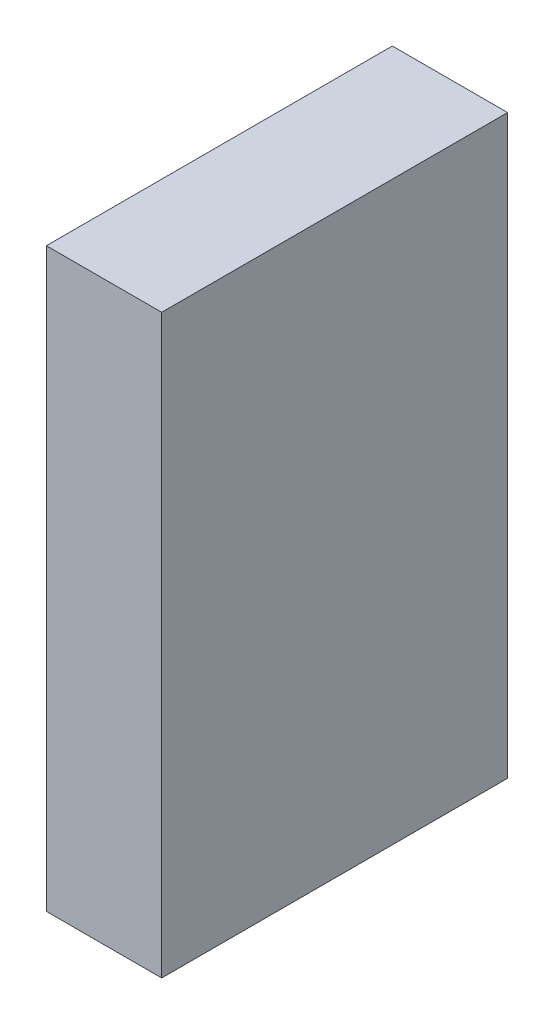
ISO-10303-21;
HEADER;
FILE_DESCRIPTION(('STEP AP214'),'2;1');
FILE_NAME('part.step','',(''),(''),'','','');
FILE_SCHEMA(('AUTOMOTIVE_DESIGN { 1 0 10303 214 1 1 1 1 }'));
ENDSEC;
DATA;
#1=APPLICATION_CONTEXT('core data for automotive mechanical design processes');
#2=APPLICATION_PROTOCOL_DEFINITION('international standard','automotive_design',2000,#1);
#3=PRODUCT_CONTEXT('',#1,'mechanical');
#4=PRODUCT('Part','Part','',(#3));
#5=PRODUCT_RELATED_PRODUCT_CATEGORY('part','',(#4));
#6=PRODUCT_DEFINITION_FORMATION('','',#4);
#7=PRODUCT_DEFINITION_CONTEXT('part definition',#1,'design');
#8=PRODUCT_DEFINITION('design','',#6,#7);
#9=PRODUCT_DEFINITION_SHAPE('','',#8);
#10=(LENGTH_UNIT() NAMED_UNIT(*) SI_UNIT(.MILLI.,.METRE.));
#11=(NAMED_UNIT(*) PLANE_ANGLE_UNIT() SI_UNIT($,.RADIAN.));
#12=(NAMED_UNIT(*) SI_UNIT($,.STERADIAN.) SOLID_ANGLE_UNIT());
#13=UNCERTAINTY_MEASURE_WITH_UNIT(LENGTH_MEASURE(1.E-05),#10,'distance_accuracy_value','');
#14=(GEOMETRIC_REPRESENTATION_CONTEXT(3) GLOBAL_UNCERTAINTY_ASSIGNED_CONTEXT((#13)) GLOBAL_UNIT_ASSIGNED_CONTEXT((#10,
#11,#12)) REPRESENTATION_CONTEXT('',''));
#15=CARTESIAN_POINT('',(0.,0.,0.));
#16=DIRECTION('',(0.,0.,1.));
#17=DIRECTION('',(1.,0.,0.));
#18=AXIS2_PLACEMENT_3D('',#15,#16,#17);
#19=CARTESIAN_POINT('',(0.0635,-0.3175,0.));
#20=DIRECTION('',(-1.,0.,0.));
#21=DIRECTION('',(0.,0.,1.));
#22=AXIS2_PLACEMENT_3D('',#19,#20,#21);
#23=PLANE('',#22);
#24=DIRECTION('',(0.,0.,-1.));
#25=VECTOR('',#24,1.);
#26=CARTESIAN_POINT('',(0.0635,0.3175,0.));
#27=LINE('',#26,#25);
#28=CARTESIAN_POINT('',(0.0635,0.3175,0.));
#29=VERTEX_POINT('',#28);
#30=CARTESIAN_POINT('',(0.0635,0.3175,0.381));
#31=VERTEX_POINT('',#30);
#32=EDGE_CURVE('E20',#29,#31,#27,.F.);
#33=ORIENTED_EDGE('',*,*,#32,.T.);
#34=DIRECTION('',(0.,1.,0.));
#35=VECTOR('',#34,1.);
#36=CARTESIAN_POINT('',(0.0635,0.3175,0.381));
#37=LINE('',#36,#35);
#38=CARTESIAN_POINT('',(0.0635,-0.3175,0.381));
#39=VERTEX_POINT('',#38);
#40=EDGE_CURVE('E55',#31,#39,#37,.F.);
#41=ORIENTED_EDGE('',*,*,#40,.T.);
#42=DIRECTION('',(0.,0.,1.));
#43=VECTOR('',#42,1.);
#44=CARTESIAN_POINT('',(0.0635,-0.3175,0.));
#45=LINE('',#44,#43);
#46=CARTESIAN_POINT('',(0.0635,-0.3175,0.));
#47=VERTEX_POINT('',#46);
#48=EDGE_CURVE('E74',#39,#47,#45,.F.);
#49=ORIENTED_EDGE('',*,*,#48,.T.);
#50=DIRECTION('',(0.,1.,0.));
#51=VECTOR('',#50,1.);
#52=CARTESIAN_POINT('',(0.0635,0.3175,0.));
#53=LINE('',#52,#51);
#54=EDGE_CURVE('E66',#29,#47,#53,.F.);
#55=ORIENTED_EDGE('',*,*,#54,.F.);
#56=EDGE_LOOP('',(#33,#41,#49,#55));
#57=FACE_BOUND('',#56,.T.);
#58=ADVANCED_FACE('F17',(#57),#23,.F.);
#59=CARTESIAN_POINT('',(0.0635,0.3175,0.));
#60=DIRECTION('',(0.,-1.,0.));
#61=DIRECTION('',(0.,0.,-1.));
#62=AXIS2_PLACEMENT_3D('',#59,#60,#61);
#63=PLANE('',#62);
#64=DIRECTION('',(0.,0.,-1.));
#65=VECTOR('',#64,1.);
#66=CARTESIAN_POINT('',(-0.0635,0.3175,0.));
#67=LINE('',#66,#65);
#68=CARTESIAN_POINT('',(-0.0635,0.3175,0.));
#69=VERTEX_POINT('',#68);
#70=CARTESIAN_POINT('',(-0.0635,0.3175,0.381));
#71=VERTEX_POINT('',#70);
#72=EDGE_CURVE('E72',#69,#71,#67,.F.);
#73=ORIENTED_EDGE('',*,*,#72,.T.);
#74=DIRECTION('',(-1.,0.,0.));
#75=VECTOR('',#74,1.);
#76=CARTESIAN_POINT('',(0.0635,0.3175,0.381));
#77=LINE('',#76,#75);
#78=EDGE_CURVE('E62',#71,#31,#77,.F.);
#79=ORIENTED_EDGE('',*,*,#78,.T.);
#80=ORIENTED_EDGE('',*,*,#32,.F.);
#81=DIRECTION('',(-1.,0.,0.));
#82=VECTOR('',#81,1.);
#83=CARTESIAN_POINT('',(0.0635,0.3175,0.));
#84=LINE('',#83,#82);
#85=EDGE_CURVE('E80',#69,#29,#84,.F.);
#86=ORIENTED_EDGE('',*,*,#85,.F.);
#87=EDGE_LOOP('',(#73,#79,#80,#86));
#88=FACE_BOUND('',#87,.T.);
#89=ADVANCED_FACE('F71',(#88),#63,.F.);
#90=CARTESIAN_POINT('',(0.0635,0.3175,0.381));
#91=DIRECTION('',(0.,0.,-1.));
#92=DIRECTION('',(-1.,0.,0.));
#93=AXIS2_PLACEMENT_3D('',#90,#91,#92);
#94=PLANE('',#93);
#95=DIRECTION('',(0.,1.,0.));
#96=VECTOR('',#95,1.);
#97=CARTESIAN_POINT('',(-0.0635,0.3175,0.381));
#98=LINE('',#97,#96);
#99=CARTESIAN_POINT('',(-0.0635,-0.3175,0.381));
#100=VERTEX_POINT('',#99);
#101=EDGE_CURVE('E83',#71,#100,#98,.F.);
#102=ORIENTED_EDGE('',*,*,#101,.T.);
#103=DIRECTION('',(1.,0.,0.));
#104=VECTOR('',#103,1.);
#105=CARTESIAN_POINT('',(-0.0635,-0.3175,0.381));
#106=LINE('',#105,#104);
#107=EDGE_CURVE('E64',#100,#39,#106,.T.);
#108=ORIENTED_EDGE('',*,*,#107,.T.);
#109=ORIENTED_EDGE('',*,*,#40,.F.);
#110=ORIENTED_EDGE('',*,*,#78,.F.);
#111=EDGE_LOOP('',(#102,#108,#109,#110));
#112=FACE_BOUND('',#111,.T.);
#113=ADVANCED_FACE('F60',(#112),#94,.F.);
#114=CARTESIAN_POINT('',(-0.0635,-0.3175,0.));
#115=DIRECTION('',(0.,1.,0.));
#116=DIRECTION('',(0.,0.,1.));
#117=AXIS2_PLACEMENT_3D('',#114,#115,#116);
#118=PLANE('',#117);
#119=ORIENTED_EDGE('',*,*,#48,.F.);
#120=ORIENTED_EDGE('',*,*,#107,.F.);
#121=DIRECTION('',(0.,0.,-1.));
#122=VECTOR('',#121,1.);
#123=CARTESIAN_POINT('',(-0.0635,-0.3175,0.));
#124=LINE('',#123,#122);
#125=CARTESIAN_POINT('',(-0.0635,-0.3175,0.));
#126=VERTEX_POINT('',#125);
#127=EDGE_CURVE('E26',#100,#126,#124,.T.);
#128=ORIENTED_EDGE('',*,*,#127,.T.);
#129=DIRECTION('',(-1.,0.,0.));
#130=VECTOR('',#129,1.);
#131=CARTESIAN_POINT('',(0.0635,-0.3175,0.));
#132=LINE('',#131,#130);
#133=EDGE_CURVE('E34',#47,#126,#132,.T.);
#134=ORIENTED_EDGE('',*,*,#133,.F.);
#135=EDGE_LOOP('',(#119,#120,#128,#134));
#136=FACE_BOUND('',#135,.T.);
#137=ADVANCED_FACE('F88',(#136),#118,.F.);
#138=CARTESIAN_POINT('',(0.0635,0.3175,0.));
#139=DIRECTION('',(0.,0.,-1.));
#140=DIRECTION('',(-1.,0.,0.));
#141=AXIS2_PLACEMENT_3D('',#138,#139,#140);
#142=PLANE('',#141);
#143=DIRECTION('',(0.,1.,0.));
#144=VECTOR('',#143,1.);
#145=CARTESIAN_POINT('',(-0.0635,0.3175,0.));
#146=LINE('',#145,#144);
#147=EDGE_CURVE('E11',#126,#69,#146,.T.);
#148=ORIENTED_EDGE('',*,*,#147,.T.);
#149=ORIENTED_EDGE('',*,*,#85,.T.);
#150=ORIENTED_EDGE('',*,*,#54,.T.);
#151=ORIENTED_EDGE('',*,*,#133,.T.);
#152=EDGE_LOOP('',(#148,#149,#150,#151));
#153=FACE_BOUND('',#152,.T.);
#154=ADVANCED_FACE('F91',(#153),#142,.T.);
#155=CARTESIAN_POINT('',(-0.0635,0.3175,0.));
#156=DIRECTION('',(1.,0.,0.));
#157=DIRECTION('',(0.,0.,-1.));
#158=AXIS2_PLACEMENT_3D('',#155,#156,#157);
#159=PLANE('',#158);
#160=ORIENTED_EDGE('',*,*,#127,.F.);
#161=ORIENTED_EDGE('',*,*,#101,.F.);
#162=ORIENTED_EDGE('',*,*,#72,.F.);
#163=ORIENTED_EDGE('',*,*,#147,.F.);
#164=EDGE_LOOP('',(#160,#161,#162,#163));
#165=FACE_BOUND('',#164,.T.);
#166=ADVANCED_FACE('F90',(#165),#159,.F.);
#167=CLOSED_SHELL('',(#58,#89,#113,#137,#154,#166));
#168=MANIFOLD_SOLID_BREP('B1',#167);
#169=ADVANCED_BREP_SHAPE_REPRESENTATION('',(#18,#168),#14);
#170=SHAPE_DEFINITION_REPRESENTATION(#9,#169);
ENDSEC;
END-ISO-10303-21;
